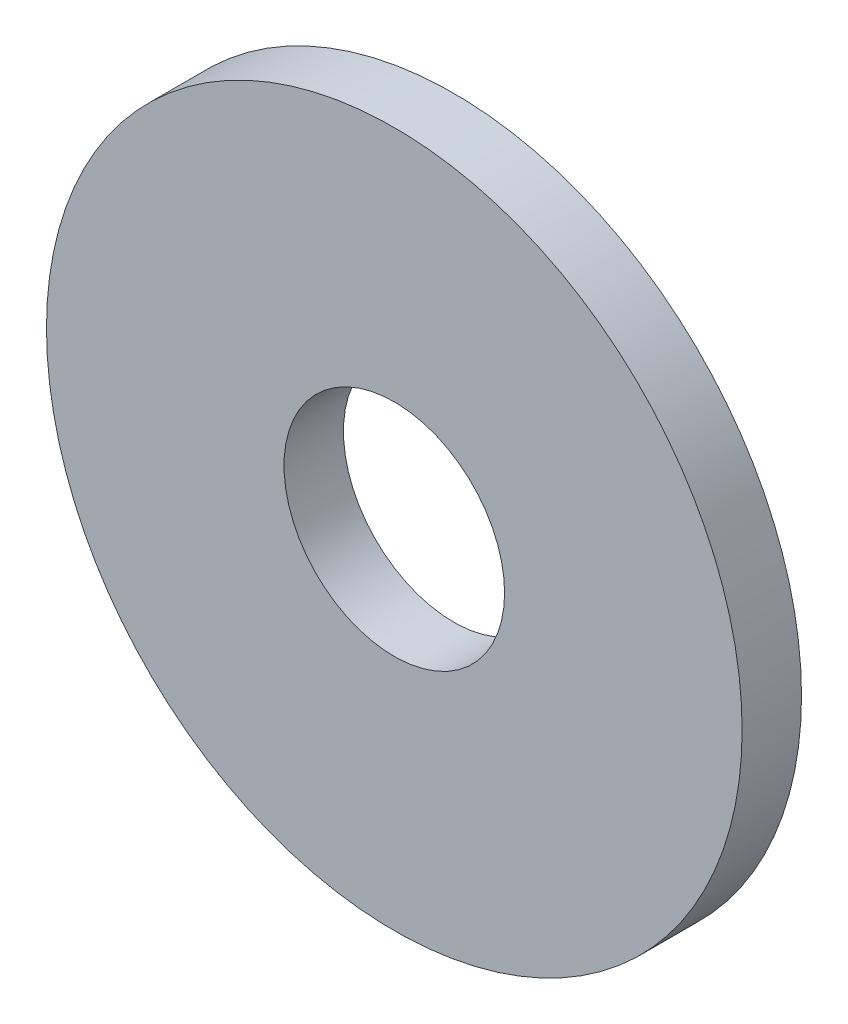
ISO-10303-21;
HEADER;
FILE_DESCRIPTION(('STEP AP214'),'2;1');
FILE_NAME('part.step','',(''),(''),'','','');
FILE_SCHEMA(('AUTOMOTIVE_DESIGN { 1 0 10303 214 1 1 1 1 }'));
ENDSEC;
DATA;
#1=APPLICATION_CONTEXT('core data for automotive mechanical design processes');
#2=APPLICATION_PROTOCOL_DEFINITION('international standard','automotive_design',2000,#1);
#3=PRODUCT_CONTEXT('',#1,'mechanical');
#4=PRODUCT('Part','Part','',(#3));
#5=PRODUCT_RELATED_PRODUCT_CATEGORY('part','',(#4));
#6=PRODUCT_DEFINITION_FORMATION('','',#4);
#7=PRODUCT_DEFINITION_CONTEXT('part definition',#1,'design');
#8=PRODUCT_DEFINITION('design','',#6,#7);
#9=PRODUCT_DEFINITION_SHAPE('','',#8);
#10=(LENGTH_UNIT() NAMED_UNIT(*) SI_UNIT(.MILLI.,.METRE.));
#11=(NAMED_UNIT(*) PLANE_ANGLE_UNIT() SI_UNIT($,.RADIAN.));
#12=(NAMED_UNIT(*) SI_UNIT($,.STERADIAN.) SOLID_ANGLE_UNIT());
#13=UNCERTAINTY_MEASURE_WITH_UNIT(LENGTH_MEASURE(1.E-05),#10,'distance_accuracy_value','');
#14=(GEOMETRIC_REPRESENTATION_CONTEXT(3) GLOBAL_UNCERTAINTY_ASSIGNED_CONTEXT((#13)) GLOBAL_UNIT_ASSIGNED_CONTEXT((#10,
#11,#12)) REPRESENTATION_CONTEXT('',''));
#15=CARTESIAN_POINT('',(0.,0.,0.));
#16=DIRECTION('',(0.,0.,1.));
#17=DIRECTION('',(1.,0.,0.));
#18=AXIS2_PLACEMENT_3D('',#15,#16,#17);
#19=CARTESIAN_POINT('',(0.,0.,2.8));
#20=DIRECTION('',(0.,0.,1.));
#21=DIRECTION('',(1.,0.,0.));
#22=AXIS2_PLACEMENT_3D('',#19,#20,#21);
#23=PLANE('',#22);
#24=CARTESIAN_POINT('',(0.,0.,2.8));
#25=DIRECTION('',(0.,0.,1.));
#26=DIRECTION('',(1.,0.,0.));
#27=AXIS2_PLACEMENT_3D('',#24,#25,#26);
#28=CIRCLE('',#27,16.4);
#29=CARTESIAN_POINT('',(16.4,0.,2.8));
#30=VERTEX_POINT('',#29);
#31=EDGE_CURVE('E10',#30,#30,#28,.T.);
#32=ORIENTED_EDGE('',*,*,#31,.T.);
#33=EDGE_LOOP('',(#32));
#34=FACE_BOUND('',#33,.T.);
#35=CARTESIAN_POINT('',(0.,0.,2.8));
#36=DIRECTION('',(0.,0.,1.));
#37=DIRECTION('',(1.,0.,0.));
#38=AXIS2_PLACEMENT_3D('',#35,#36,#37);
#39=CIRCLE('',#38,5.2);
#40=CARTESIAN_POINT('',(5.2,0.,2.8));
#41=VERTEX_POINT('',#40);
#42=EDGE_CURVE('E42',#41,#41,#39,.T.);
#43=ORIENTED_EDGE('',*,*,#42,.F.);
#44=EDGE_LOOP('',(#43));
#45=FACE_BOUND('',#44,.T.);
#46=ADVANCED_FACE('F31',(#34,#45),#23,.T.);
#47=CARTESIAN_POINT('',(0.,0.,0.));
#48=DIRECTION('',(0.,0.,1.));
#49=DIRECTION('',(1.,0.,0.));
#50=AXIS2_PLACEMENT_3D('',#47,#48,#49);
#51=PLANE('',#50);
#52=CARTESIAN_POINT('',(0.,0.,0.));
#53=DIRECTION('',(0.,0.,1.));
#54=DIRECTION('',(1.,0.,0.));
#55=AXIS2_PLACEMENT_3D('',#52,#53,#54);
#56=CIRCLE('',#55,16.4);
#57=CARTESIAN_POINT('',(16.4,0.,0.));
#58=VERTEX_POINT('',#57);
#59=EDGE_CURVE('E35',#58,#58,#56,.T.);
#60=ORIENTED_EDGE('',*,*,#59,.F.);
#61=EDGE_LOOP('',(#60));
#62=FACE_BOUND('',#61,.T.);
#63=CARTESIAN_POINT('',(0.,0.,0.));
#64=DIRECTION('',(0.,0.,1.));
#65=DIRECTION('',(1.,0.,0.));
#66=AXIS2_PLACEMENT_3D('',#63,#64,#65);
#67=CIRCLE('',#66,5.2);
#68=CARTESIAN_POINT('',(5.2,0.,0.));
#69=VERTEX_POINT('',#68);
#70=EDGE_CURVE('E44',#69,#69,#67,.T.);
#71=ORIENTED_EDGE('',*,*,#70,.T.);
#72=EDGE_LOOP('',(#71));
#73=FACE_BOUND('',#72,.T.);
#74=ADVANCED_FACE('F54',(#62,#73),#51,.F.);
#75=CARTESIAN_POINT('',(0.,0.,2.8));
#76=DIRECTION('',(0.,0.,-1.));
#77=DIRECTION('',(-1.,0.,0.));
#78=AXIS2_PLACEMENT_3D('',#75,#76,#77);
#79=CYLINDRICAL_SURFACE('',#78,16.4);
#80=ORIENTED_EDGE('',*,*,#31,.F.);
#81=EDGE_LOOP('',(#80));
#82=FACE_BOUND('',#81,.T.);
#83=ORIENTED_EDGE('',*,*,#59,.T.);
#84=EDGE_LOOP('',(#83));
#85=FACE_BOUND('',#84,.T.);
#86=ADVANCED_FACE('F33',(#82,#85),#79,.T.);
#87=CARTESIAN_POINT('',(0.,0.,2.8));
#88=DIRECTION('',(0.,0.,-1.));
#89=DIRECTION('',(-1.,0.,0.));
#90=AXIS2_PLACEMENT_3D('',#87,#88,#89);
#91=CYLINDRICAL_SURFACE('',#90,5.2);
#92=ORIENTED_EDGE('',*,*,#42,.T.);
#93=EDGE_LOOP('',(#92));
#94=FACE_BOUND('',#93,.T.);
#95=ORIENTED_EDGE('',*,*,#70,.F.);
#96=EDGE_LOOP('',(#95));
#97=FACE_BOUND('',#96,.T.);
#98=ADVANCED_FACE('F50',(#94,#97),#91,.F.);
#99=CLOSED_SHELL('',(#46,#74,#86,#98));
#100=MANIFOLD_SOLID_BREP('B2',#99);
#101=ADVANCED_BREP_SHAPE_REPRESENTATION('',(#18,#100),#14);
#102=SHAPE_DEFINITION_REPRESENTATION(#9,#101);
ENDSEC;
END-ISO-10303-21;
